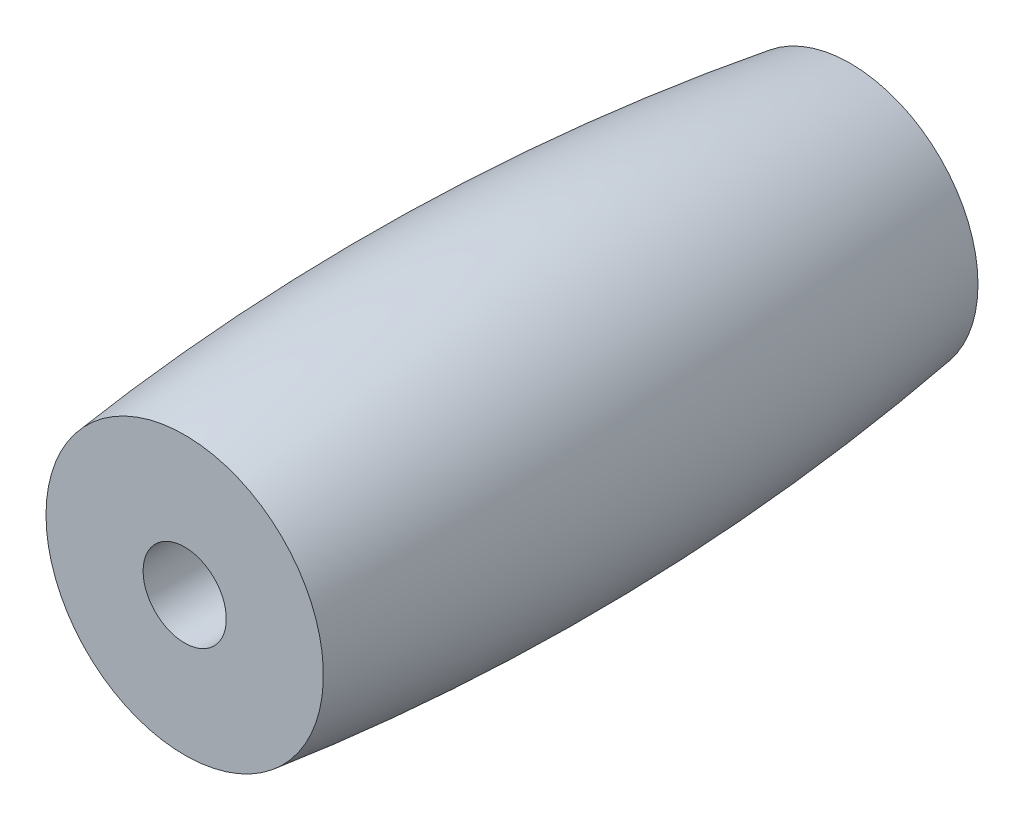
ISO-10303-21;
HEADER;
FILE_DESCRIPTION(('STEP AP214'),'2;1');
FILE_NAME('part.step','',(''),(''),'','','');
FILE_SCHEMA(('AUTOMOTIVE_DESIGN { 1 0 10303 214 1 1 1 1 }'));
ENDSEC;
DATA;
#1=APPLICATION_CONTEXT('core data for automotive mechanical design processes');
#2=APPLICATION_PROTOCOL_DEFINITION('international standard','automotive_design',2000,#1);
#3=PRODUCT_CONTEXT('',#1,'mechanical');
#4=PRODUCT('Part','Part','',(#3));
#5=PRODUCT_RELATED_PRODUCT_CATEGORY('part','',(#4));
#6=PRODUCT_DEFINITION_FORMATION('','',#4);
#7=PRODUCT_DEFINITION_CONTEXT('part definition',#1,'design');
#8=PRODUCT_DEFINITION('design','',#6,#7);
#9=PRODUCT_DEFINITION_SHAPE('','',#8);
#10=(LENGTH_UNIT() NAMED_UNIT(*) SI_UNIT(.MILLI.,.METRE.));
#11=(NAMED_UNIT(*) PLANE_ANGLE_UNIT() SI_UNIT($,.RADIAN.));
#12=(NAMED_UNIT(*) SI_UNIT($,.STERADIAN.) SOLID_ANGLE_UNIT());
#13=UNCERTAINTY_MEASURE_WITH_UNIT(LENGTH_MEASURE(1.E-05),#10,'distance_accuracy_value','');
#14=(GEOMETRIC_REPRESENTATION_CONTEXT(3) GLOBAL_UNCERTAINTY_ASSIGNED_CONTEXT((#13)) GLOBAL_UNIT_ASSIGNED_CONTEXT((#10,
#11,#12)) REPRESENTATION_CONTEXT('',''));
#15=CARTESIAN_POINT('',(0.,0.,0.));
#16=DIRECTION('',(0.,0.,1.));
#17=DIRECTION('',(1.,0.,0.));
#18=AXIS2_PLACEMENT_3D('',#15,#16,#17);
#19=CARTESIAN_POINT('',(0.,0.,54.));
#20=DIRECTION('',(0.,0.,-1.));
#21=DIRECTION('',(-1.,0.,0.));
#22=AXIS2_PLACEMENT_3D('',#19,#20,#21);
#23=CYLINDRICAL_SURFACE('',#22,2.38125);
#24=CARTESIAN_POINT('',(0.,0.,-40.6070987752124));
#25=DIRECTION('',(0.,0.,-1.));
#26=DIRECTION('',(-1.,0.,0.));
#27=AXIS2_PLACEMENT_3D('',#24,#25,#26);
#28=CIRCLE('',#27,2.38125);
#29=CARTESIAN_POINT('',(-2.38125,0.,-40.6070987752124));
#30=VERTEX_POINT('',#29);
#31=EDGE_CURVE('E18',#30,#30,#28,.F.);
#32=ORIENTED_EDGE('',*,*,#31,.F.);
#33=EDGE_LOOP('',(#32));
#34=FACE_BOUND('',#33,.T.);
#35=CARTESIAN_POINT('',(0.,0.,-2.50709877521237));
#36=DIRECTION('',(0.,0.,-1.));
#37=DIRECTION('',(-1.,0.,0.));
#38=AXIS2_PLACEMENT_3D('',#35,#36,#37);
#39=CIRCLE('',#38,2.38125);
#40=CARTESIAN_POINT('',(-2.38125,0.,-2.50709877521237));
#41=VERTEX_POINT('',#40);
#42=EDGE_CURVE('E27',#41,#41,#39,.T.);
#43=ORIENTED_EDGE('',*,*,#42,.F.);
#44=EDGE_LOOP('',(#43));
#45=FACE_BOUND('',#44,.T.);
#46=ADVANCED_FACE('F14',(#34,#45),#23,.F.);
#47=CARTESIAN_POINT('',(2.38125,0.,-40.6070987752124));
#48=DIRECTION('',(0.,0.,-1.));
#49=DIRECTION('',(-1.,0.,0.));
#50=AXIS2_PLACEMENT_3D('',#47,#48,#49);
#51=PLANE('',#50);
#52=ORIENTED_EDGE('',*,*,#31,.T.);
#53=EDGE_LOOP('',(#52));
#54=FACE_BOUND('',#53,.T.);
#55=CARTESIAN_POINT('',(-3.47869881049214E-13,-1.2755363034913E-13,-40.6070987752123));
#56=DIRECTION('',(0.,0.,-1.));
#57=DIRECTION('',(-1.,0.,0.));
#58=AXIS2_PLACEMENT_3D('',#55,#56,#57);
#59=CIRCLE('',#58,7.30249999999968);
#60=CARTESIAN_POINT('',(-7.30250000000003,-1.2755363034913E-13,-40.6070987752123));
#61=VERTEX_POINT('',#60);
#62=EDGE_CURVE('E22',#61,#61,#59,.F.);
#63=ORIENTED_EDGE('',*,*,#62,.F.);
#64=EDGE_LOOP('',(#63));
#65=FACE_BOUND('',#64,.T.);
#66=ADVANCED_FACE('F35',(#54,#65),#51,.T.);
#67=CARTESIAN_POINT('',(2.38125,0.,-2.50709877521235));
#68=DIRECTION('',(0.,0.,1.));
#69=DIRECTION('',(1.,0.,0.));
#70=AXIS2_PLACEMENT_3D('',#67,#68,#69);
#71=PLANE('',#70);
#72=ORIENTED_EDGE('',*,*,#42,.T.);
#73=EDGE_LOOP('',(#72));
#74=FACE_BOUND('',#73,.T.);
#75=CARTESIAN_POINT('',(-4.20275730481293E-13,-1.6375655506517E-13,-2.50709877521246));
#76=DIRECTION('',(0.,0.,-1.));
#77=DIRECTION('',(-1.,0.,0.));
#78=AXIS2_PLACEMENT_3D('',#75,#76,#77);
#79=CIRCLE('',#78,7.93749999999963);
#80=CARTESIAN_POINT('',(-7.93750000000005,-1.6375655506517E-13,-2.50709877521247));
#81=VERTEX_POINT('',#80);
#82=EDGE_CURVE('E10',#81,#81,#79,.T.);
#83=ORIENTED_EDGE('',*,*,#82,.F.);
#84=EDGE_LOOP('',(#83));
#85=FACE_BOUND('',#84,.T.);
#86=ADVANCED_FACE('F44',(#74,#85),#71,.T.);
#87=CARTESIAN_POINT('',(-3.88578058618805E-13,-1.47907719133926E-13,-19.1864321085459));
#88=DIRECTION('',(0.,0.,-1.));
#89=DIRECTION('',(-1.,0.,0.));
#90=AXIS2_PLACEMENT_3D('',#87,#88,#89);
#91=DEGENERATE_TOROIDAL_SURFACE('',#90,134.620000000002,143.529930560475,.F.);
#92=ORIENTED_EDGE('',*,*,#82,.T.);
#93=EDGE_LOOP('',(#92));
#94=FACE_BOUND('',#93,.T.);
#95=ORIENTED_EDGE('',*,*,#62,.T.);
#96=EDGE_LOOP('',(#95));
#97=FACE_BOUND('',#96,.T.);
#98=ADVANCED_FACE('F16',(#94,#97),#91,.F.);
#99=CLOSED_SHELL('',(#46,#66,#86,#98));
#100=MANIFOLD_SOLID_BREP('B1',#99);
#101=ADVANCED_BREP_SHAPE_REPRESENTATION('',(#18,#100),#14);
#102=SHAPE_DEFINITION_REPRESENTATION(#9,#101);
ENDSEC;
END-ISO-10303-21;
